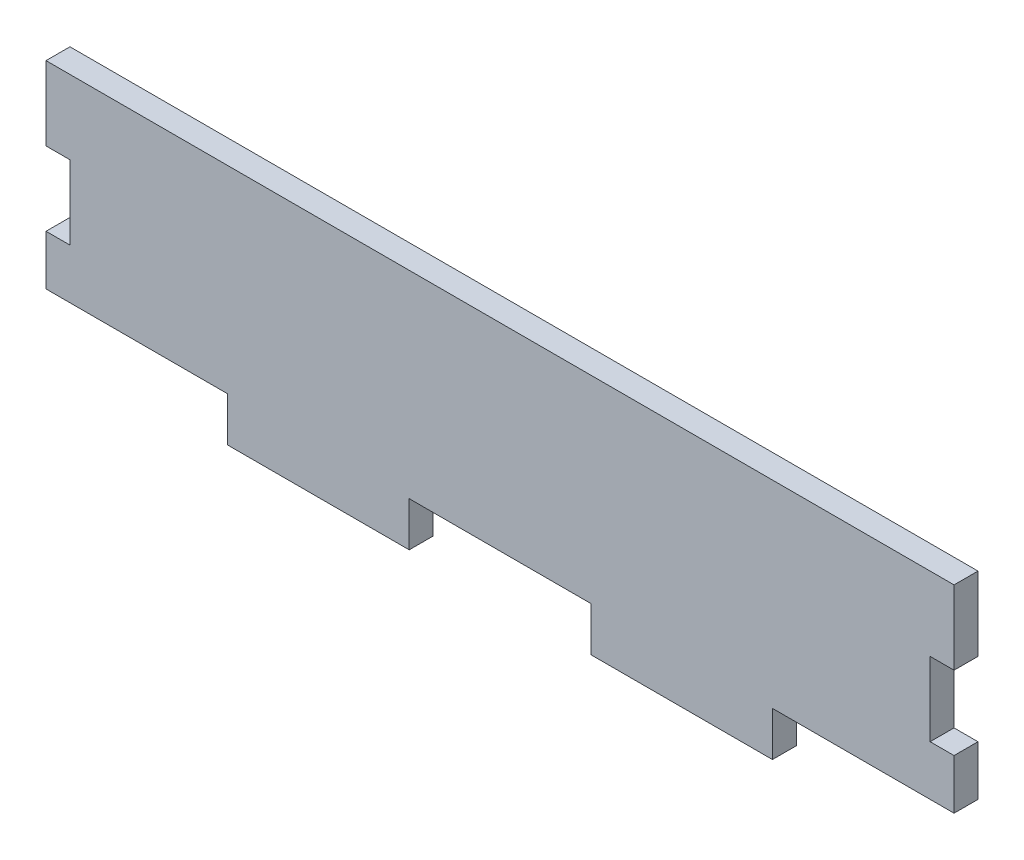
ISO-10303-21;
HEADER;
FILE_DESCRIPTION(('STEP AP214'),'2;1');
FILE_NAME('part.step','',(''),(''),'','','');
FILE_SCHEMA(('AUTOMOTIVE_DESIGN { 1 0 10303 214 1 1 1 1 }'));
ENDSEC;
DATA;
#1=APPLICATION_CONTEXT('core data for automotive mechanical design processes');
#2=APPLICATION_PROTOCOL_DEFINITION('international standard','automotive_design',2000,#1);
#3=PRODUCT_CONTEXT('',#1,'mechanical');
#4=PRODUCT('Part','Part','',(#3));
#5=PRODUCT_RELATED_PRODUCT_CATEGORY('part','',(#4));
#6=PRODUCT_DEFINITION_FORMATION('','',#4);
#7=PRODUCT_DEFINITION_CONTEXT('part definition',#1,'design');
#8=PRODUCT_DEFINITION('design','',#6,#7);
#9=PRODUCT_DEFINITION_SHAPE('','',#8);
#10=(LENGTH_UNIT() NAMED_UNIT(*) SI_UNIT(.MILLI.,.METRE.));
#11=(NAMED_UNIT(*) PLANE_ANGLE_UNIT() SI_UNIT($,.RADIAN.));
#12=(NAMED_UNIT(*) SI_UNIT($,.STERADIAN.) SOLID_ANGLE_UNIT());
#13=UNCERTAINTY_MEASURE_WITH_UNIT(LENGTH_MEASURE(1.E-05),#10,'distance_accuracy_value','');
#14=(GEOMETRIC_REPRESENTATION_CONTEXT(3) GLOBAL_UNCERTAINTY_ASSIGNED_CONTEXT((#13)) GLOBAL_UNIT_ASSIGNED_CONTEXT((#10,
#11,#12)) REPRESENTATION_CONTEXT('',''));
#15=CARTESIAN_POINT('',(0.,0.,0.));
#16=DIRECTION('',(0.,0.,1.));
#17=DIRECTION('',(1.,0.,0.));
#18=AXIS2_PLACEMENT_3D('',#15,#16,#17);
#19=CARTESIAN_POINT('',(-51.2,4.16666666666666,2.7));
#20=DIRECTION('',(1.,0.,0.));
#21=DIRECTION('',(0.,0.,-1.));
#22=AXIS2_PLACEMENT_3D('',#19,#20,#21);
#23=PLANE('',#22);
#24=DIRECTION('',(0.,-1.,0.));
#25=VECTOR('',#24,1.);
#26=CARTESIAN_POINT('',(-51.2,4.16666666666666,0.));
#27=LINE('',#26,#25);
#28=CARTESIAN_POINT('',(-51.2,12.5,0.));
#29=VERTEX_POINT('',#28);
#30=CARTESIAN_POINT('',(-51.2,4.16666666666666,0.));
#31=VERTEX_POINT('',#30);
#32=EDGE_CURVE('E201',#29,#31,#27,.T.);
#33=ORIENTED_EDGE('',*,*,#32,.T.);
#34=DIRECTION('',(0.,0.,-1.));
#35=VECTOR('',#34,1.);
#36=CARTESIAN_POINT('',(-51.2,4.16666666666666,2.7));
#37=LINE('',#36,#35);
#38=CARTESIAN_POINT('',(-51.2,4.16666666666666,2.7));
#39=VERTEX_POINT('',#38);
#40=EDGE_CURVE('E11',#39,#31,#37,.T.);
#41=ORIENTED_EDGE('',*,*,#40,.F.);
#42=DIRECTION('',(0.,-1.,0.));
#43=VECTOR('',#42,1.);
#44=CARTESIAN_POINT('',(-51.2,4.16666666666666,2.7));
#45=LINE('',#44,#43);
#46=CARTESIAN_POINT('',(-51.2,12.5,2.7));
#47=VERTEX_POINT('',#46);
#48=EDGE_CURVE('E243',#47,#39,#45,.T.);
#49=ORIENTED_EDGE('',*,*,#48,.F.);
#50=DIRECTION('',(0.,0.,-1.));
#51=VECTOR('',#50,1.);
#52=CARTESIAN_POINT('',(-51.2,12.5,2.7));
#53=LINE('',#52,#51);
#54=EDGE_CURVE('E197',#47,#29,#53,.T.);
#55=ORIENTED_EDGE('',*,*,#54,.T.);
#56=EDGE_LOOP('',(#33,#41,#49,#55));
#57=FACE_BOUND('',#56,.T.);
#58=ADVANCED_FACE('F33',(#57),#23,.F.);
#59=CARTESIAN_POINT('',(-51.2,4.16666666666666,2.7));
#60=DIRECTION('',(0.,1.,0.));
#61=DIRECTION('',(0.,0.,1.));
#62=AXIS2_PLACEMENT_3D('',#59,#60,#61);
#63=PLANE('',#62);
#64=DIRECTION('',(1.,0.,0.));
#65=VECTOR('',#64,1.);
#66=CARTESIAN_POINT('',(-51.2,4.16666666666666,0.));
#67=LINE('',#66,#65);
#68=CARTESIAN_POINT('',(-48.5,4.16666666666666,0.));
#69=VERTEX_POINT('',#68);
#70=EDGE_CURVE('E204',#31,#69,#67,.T.);
#71=ORIENTED_EDGE('',*,*,#70,.T.);
#72=DIRECTION('',(0.,0.,-1.));
#73=VECTOR('',#72,1.);
#74=CARTESIAN_POINT('',(-48.5,4.16666666666666,2.7));
#75=LINE('',#74,#73);
#76=CARTESIAN_POINT('',(-48.5,4.16666666666666,2.7));
#77=VERTEX_POINT('',#76);
#78=EDGE_CURVE('E41',#77,#69,#75,.T.);
#79=ORIENTED_EDGE('',*,*,#78,.F.);
#80=DIRECTION('',(1.,0.,0.));
#81=VECTOR('',#80,1.);
#82=CARTESIAN_POINT('',(-51.2,4.16666666666666,2.7));
#83=LINE('',#82,#81);
#84=EDGE_CURVE('E128',#39,#77,#83,.T.);
#85=ORIENTED_EDGE('',*,*,#84,.F.);
#86=ORIENTED_EDGE('',*,*,#40,.T.);
#87=EDGE_LOOP('',(#71,#79,#85,#86));
#88=FACE_BOUND('',#87,.T.);
#89=ADVANCED_FACE('F361',(#88),#63,.F.);
#90=CARTESIAN_POINT('',(-48.5,4.16666666666666,2.7));
#91=DIRECTION('',(1.,0.,0.));
#92=DIRECTION('',(0.,0.,-1.));
#93=AXIS2_PLACEMENT_3D('',#90,#91,#92);
#94=PLANE('',#93);
#95=DIRECTION('',(0.,-1.,0.));
#96=VECTOR('',#95,1.);
#97=CARTESIAN_POINT('',(-48.5,4.16666666666666,0.));
#98=LINE('',#97,#96);
#99=CARTESIAN_POINT('',(-48.5,-4.16666666666667,0.));
#100=VERTEX_POINT('',#99);
#101=EDGE_CURVE('E206',#69,#100,#98,.T.);
#102=ORIENTED_EDGE('',*,*,#101,.T.);
#103=DIRECTION('',(0.,0.,-1.));
#104=VECTOR('',#103,1.);
#105=CARTESIAN_POINT('',(-48.5,-4.16666666666667,2.7));
#106=LINE('',#105,#104);
#107=CARTESIAN_POINT('',(-48.5,-4.16666666666667,2.7));
#108=VERTEX_POINT('',#107);
#109=EDGE_CURVE('E286',#108,#100,#106,.T.);
#110=ORIENTED_EDGE('',*,*,#109,.F.);
#111=DIRECTION('',(0.,-1.,0.));
#112=VECTOR('',#111,1.);
#113=CARTESIAN_POINT('',(-48.5,4.16666666666666,2.7));
#114=LINE('',#113,#112);
#115=EDGE_CURVE('E294',#77,#108,#114,.T.);
#116=ORIENTED_EDGE('',*,*,#115,.F.);
#117=ORIENTED_EDGE('',*,*,#78,.T.);
#118=EDGE_LOOP('',(#102,#110,#116,#117));
#119=FACE_BOUND('',#118,.T.);
#120=ADVANCED_FACE('F292',(#119),#94,.F.);
#121=CARTESIAN_POINT('',(-51.2,-4.16666666666668,2.7));
#122=DIRECTION('',(0.,-1.,0.));
#123=DIRECTION('',(1.,0.,0.));
#124=AXIS2_PLACEMENT_3D('',#121,#122,#123);
#125=PLANE('',#124);
#126=DIRECTION('',(-1.,0.,0.));
#127=VECTOR('',#126,1.);
#128=CARTESIAN_POINT('',(-51.2,-4.16666666666668,0.));
#129=LINE('',#128,#127);
#130=CARTESIAN_POINT('',(-51.2,-4.16666666666668,0.));
#131=VERTEX_POINT('',#130);
#132=EDGE_CURVE('E208',#100,#131,#129,.T.);
#133=ORIENTED_EDGE('',*,*,#132,.T.);
#134=DIRECTION('',(0.,0.,-1.));
#135=VECTOR('',#134,1.);
#136=CARTESIAN_POINT('',(-51.2,-4.16666666666668,2.7));
#137=LINE('',#136,#135);
#138=CARTESIAN_POINT('',(-51.2,-4.16666666666668,2.7));
#139=VERTEX_POINT('',#138);
#140=EDGE_CURVE('E283',#139,#131,#137,.T.);
#141=ORIENTED_EDGE('',*,*,#140,.F.);
#142=DIRECTION('',(-1.,0.,0.));
#143=VECTOR('',#142,1.);
#144=CARTESIAN_POINT('',(-51.2,-4.16666666666668,2.7));
#145=LINE('',#144,#143);
#146=EDGE_CURVE('E312',#108,#139,#145,.T.);
#147=ORIENTED_EDGE('',*,*,#146,.F.);
#148=ORIENTED_EDGE('',*,*,#109,.T.);
#149=EDGE_LOOP('',(#133,#141,#147,#148));
#150=FACE_BOUND('',#149,.T.);
#151=ADVANCED_FACE('F303',(#150),#125,.F.);
#152=CARTESIAN_POINT('',(-51.2,-9.80000000000001,2.7));
#153=DIRECTION('',(1.,0.,0.));
#154=DIRECTION('',(0.,0.,-1.));
#155=AXIS2_PLACEMENT_3D('',#152,#153,#154);
#156=PLANE('',#155);
#157=DIRECTION('',(0.,-1.,0.));
#158=VECTOR('',#157,1.);
#159=CARTESIAN_POINT('',(-51.2,-9.80000000000001,0.));
#160=LINE('',#159,#158);
#161=CARTESIAN_POINT('',(-51.2,-9.80000000000001,0.));
#162=VERTEX_POINT('',#161);
#163=EDGE_CURVE('E210',#131,#162,#160,.T.);
#164=ORIENTED_EDGE('',*,*,#163,.T.);
#165=DIRECTION('',(0.,0.,-1.));
#166=VECTOR('',#165,1.);
#167=CARTESIAN_POINT('',(-51.2,-9.80000000000001,2.7));
#168=LINE('',#167,#166);
#169=CARTESIAN_POINT('',(-51.2,-9.80000000000001,2.7));
#170=VERTEX_POINT('',#169);
#171=EDGE_CURVE('E280',#170,#162,#168,.T.);
#172=ORIENTED_EDGE('',*,*,#171,.F.);
#173=DIRECTION('',(0.,-1.,0.));
#174=VECTOR('',#173,1.);
#175=CARTESIAN_POINT('',(-51.2,-9.80000000000001,2.7));
#176=LINE('',#175,#174);
#177=EDGE_CURVE('E309',#139,#170,#176,.T.);
#178=ORIENTED_EDGE('',*,*,#177,.F.);
#179=ORIENTED_EDGE('',*,*,#140,.T.);
#180=EDGE_LOOP('',(#164,#172,#178,#179));
#181=FACE_BOUND('',#180,.T.);
#182=ADVANCED_FACE('F307',(#181),#156,.F.);
#183=CARTESIAN_POINT('',(-30.72,-9.80000000000001,2.7));
#184=DIRECTION('',(0.,1.,0.));
#185=DIRECTION('',(0.,0.,1.));
#186=AXIS2_PLACEMENT_3D('',#183,#184,#185);
#187=PLANE('',#186);
#188=DIRECTION('',(1.,0.,0.));
#189=VECTOR('',#188,1.);
#190=CARTESIAN_POINT('',(-30.72,-9.80000000000001,0.));
#191=LINE('',#190,#189);
#192=CARTESIAN_POINT('',(-30.72,-9.80000000000001,0.));
#193=VERTEX_POINT('',#192);
#194=EDGE_CURVE('E212',#162,#193,#191,.T.);
#195=ORIENTED_EDGE('',*,*,#194,.T.);
#196=DIRECTION('',(0.,0.,-1.));
#197=VECTOR('',#196,1.);
#198=CARTESIAN_POINT('',(-30.72,-9.80000000000001,2.7));
#199=LINE('',#198,#197);
#200=CARTESIAN_POINT('',(-30.72,-9.80000000000001,2.7));
#201=VERTEX_POINT('',#200);
#202=EDGE_CURVE('E277',#201,#193,#199,.T.);
#203=ORIENTED_EDGE('',*,*,#202,.F.);
#204=DIRECTION('',(1.,0.,0.));
#205=VECTOR('',#204,1.);
#206=CARTESIAN_POINT('',(-30.72,-9.80000000000001,2.7));
#207=LINE('',#206,#205);
#208=EDGE_CURVE('E311',#170,#201,#207,.T.);
#209=ORIENTED_EDGE('',*,*,#208,.F.);
#210=ORIENTED_EDGE('',*,*,#171,.T.);
#211=EDGE_LOOP('',(#195,#203,#209,#210));
#212=FACE_BOUND('',#211,.T.);
#213=ADVANCED_FACE('F374',(#212),#187,.F.);
#214=CARTESIAN_POINT('',(-30.72,-12.5,2.7));
#215=DIRECTION('',(1.,0.,0.));
#216=DIRECTION('',(0.,0.,-1.));
#217=AXIS2_PLACEMENT_3D('',#214,#215,#216);
#218=PLANE('',#217);
#219=DIRECTION('',(0.,-1.,0.));
#220=VECTOR('',#219,1.);
#221=CARTESIAN_POINT('',(-30.72,-12.5,0.));
#222=LINE('',#221,#220);
#223=CARTESIAN_POINT('',(-30.72,-14.8,0.));
#224=VERTEX_POINT('',#223);
#225=EDGE_CURVE('E215',#193,#224,#222,.T.);
#226=ORIENTED_EDGE('',*,*,#225,.T.);
#227=DIRECTION('',(0.,0.,-1.));
#228=VECTOR('',#227,1.);
#229=CARTESIAN_POINT('',(-30.72,-14.8,2.7));
#230=LINE('',#229,#228);
#231=CARTESIAN_POINT('',(-30.72,-14.8,2.7));
#232=VERTEX_POINT('',#231);
#233=EDGE_CURVE('E274',#232,#224,#230,.T.);
#234=ORIENTED_EDGE('',*,*,#233,.F.);
#235=DIRECTION('',(0.,-1.,0.));
#236=VECTOR('',#235,1.);
#237=CARTESIAN_POINT('',(-30.72,-12.5,2.7));
#238=LINE('',#237,#236);
#239=EDGE_CURVE('E314',#201,#232,#238,.T.);
#240=ORIENTED_EDGE('',*,*,#239,.F.);
#241=ORIENTED_EDGE('',*,*,#202,.T.);
#242=EDGE_LOOP('',(#226,#234,#240,#241));
#243=FACE_BOUND('',#242,.T.);
#244=ADVANCED_FACE('F377',(#243),#218,.F.);
#245=CARTESIAN_POINT('',(-30.72,-14.8,2.7));
#246=DIRECTION('',(0.,1.,0.));
#247=DIRECTION('',(0.,0.,1.));
#248=AXIS2_PLACEMENT_3D('',#245,#246,#247);
#249=PLANE('',#248);
#250=DIRECTION('',(1.,0.,0.));
#251=VECTOR('',#250,1.);
#252=CARTESIAN_POINT('',(-30.72,-14.8,0.));
#253=LINE('',#252,#251);
#254=CARTESIAN_POINT('',(-10.24,-14.8,0.));
#255=VERTEX_POINT('',#254);
#256=EDGE_CURVE('E217',#224,#255,#253,.T.);
#257=ORIENTED_EDGE('',*,*,#256,.T.);
#258=DIRECTION('',(0.,0.,-1.));
#259=VECTOR('',#258,1.);
#260=CARTESIAN_POINT('',(-10.24,-14.8,2.7));
#261=LINE('',#260,#259);
#262=CARTESIAN_POINT('',(-10.24,-14.8,2.7));
#263=VERTEX_POINT('',#262);
#264=EDGE_CURVE('E271',#263,#255,#261,.T.);
#265=ORIENTED_EDGE('',*,*,#264,.F.);
#266=DIRECTION('',(1.,0.,0.));
#267=VECTOR('',#266,1.);
#268=CARTESIAN_POINT('',(-30.72,-14.8,2.7));
#269=LINE('',#268,#267);
#270=EDGE_CURVE('E320',#232,#263,#269,.T.);
#271=ORIENTED_EDGE('',*,*,#270,.F.);
#272=ORIENTED_EDGE('',*,*,#233,.T.);
#273=EDGE_LOOP('',(#257,#265,#271,#272));
#274=FACE_BOUND('',#273,.T.);
#275=ADVANCED_FACE('F381',(#274),#249,.F.);
#276=CARTESIAN_POINT('',(-10.24,-12.5,2.7));
#277=DIRECTION('',(-1.,0.,0.));
#278=DIRECTION('',(0.,0.,1.));
#279=AXIS2_PLACEMENT_3D('',#276,#277,#278);
#280=PLANE('',#279);
#281=DIRECTION('',(0.,1.,0.));
#282=VECTOR('',#281,1.);
#283=CARTESIAN_POINT('',(-10.24,-12.5,0.));
#284=LINE('',#283,#282);
#285=CARTESIAN_POINT('',(-10.24,-9.80000000000001,0.));
#286=VERTEX_POINT('',#285);
#287=EDGE_CURVE('E220',#255,#286,#284,.T.);
#288=ORIENTED_EDGE('',*,*,#287,.T.);
#289=DIRECTION('',(0.,0.,-1.));
#290=VECTOR('',#289,1.);
#291=CARTESIAN_POINT('',(-10.24,-9.80000000000001,2.7));
#292=LINE('',#291,#290);
#293=CARTESIAN_POINT('',(-10.24,-9.80000000000001,2.7));
#294=VERTEX_POINT('',#293);
#295=EDGE_CURVE('E268',#294,#286,#292,.T.);
#296=ORIENTED_EDGE('',*,*,#295,.F.);
#297=DIRECTION('',(0.,1.,0.));
#298=VECTOR('',#297,1.);
#299=CARTESIAN_POINT('',(-10.24,-12.5,2.7));
#300=LINE('',#299,#298);
#301=EDGE_CURVE('E322',#263,#294,#300,.T.);
#302=ORIENTED_EDGE('',*,*,#301,.F.);
#303=ORIENTED_EDGE('',*,*,#264,.T.);
#304=EDGE_LOOP('',(#288,#296,#302,#303));
#305=FACE_BOUND('',#304,.T.);
#306=ADVANCED_FACE('F385',(#305),#280,.F.);
#307=CARTESIAN_POINT('',(10.24,-9.80000000000001,2.7));
#308=DIRECTION('',(0.,1.,0.));
#309=DIRECTION('',(0.,0.,1.));
#310=AXIS2_PLACEMENT_3D('',#307,#308,#309);
#311=PLANE('',#310);
#312=DIRECTION('',(1.,0.,0.));
#313=VECTOR('',#312,1.);
#314=CARTESIAN_POINT('',(10.24,-9.80000000000001,0.));
#315=LINE('',#314,#313);
#316=CARTESIAN_POINT('',(10.24,-9.80000000000001,0.));
#317=VERTEX_POINT('',#316);
#318=EDGE_CURVE('E222',#286,#317,#315,.T.);
#319=ORIENTED_EDGE('',*,*,#318,.T.);
#320=DIRECTION('',(0.,0.,-1.));
#321=VECTOR('',#320,1.);
#322=CARTESIAN_POINT('',(10.24,-9.80000000000001,2.7));
#323=LINE('',#322,#321);
#324=CARTESIAN_POINT('',(10.24,-9.80000000000001,2.7));
#325=VERTEX_POINT('',#324);
#326=EDGE_CURVE('E265',#325,#317,#323,.T.);
#327=ORIENTED_EDGE('',*,*,#326,.F.);
#328=DIRECTION('',(1.,0.,0.));
#329=VECTOR('',#328,1.);
#330=CARTESIAN_POINT('',(10.24,-9.80000000000001,2.7));
#331=LINE('',#330,#329);
#332=EDGE_CURVE('E324',#294,#325,#331,.T.);
#333=ORIENTED_EDGE('',*,*,#332,.F.);
#334=ORIENTED_EDGE('',*,*,#295,.T.);
#335=EDGE_LOOP('',(#319,#327,#333,#334));
#336=FACE_BOUND('',#335,.T.);
#337=ADVANCED_FACE('F389',(#336),#311,.F.);
#338=CARTESIAN_POINT('',(10.24,-12.5,2.7));
#339=DIRECTION('',(1.,0.,0.));
#340=DIRECTION('',(0.,1.,0.));
#341=AXIS2_PLACEMENT_3D('',#338,#339,#340);
#342=PLANE('',#341);
#343=DIRECTION('',(0.,-1.,0.));
#344=VECTOR('',#343,1.);
#345=CARTESIAN_POINT('',(10.24,-12.5,0.));
#346=LINE('',#345,#344);
#347=CARTESIAN_POINT('',(10.24,-14.8,0.));
#348=VERTEX_POINT('',#347);
#349=EDGE_CURVE('E225',#317,#348,#346,.T.);
#350=ORIENTED_EDGE('',*,*,#349,.T.);
#351=DIRECTION('',(0.,0.,-1.));
#352=VECTOR('',#351,1.);
#353=CARTESIAN_POINT('',(10.24,-14.8,2.7));
#354=LINE('',#353,#352);
#355=CARTESIAN_POINT('',(10.24,-14.8,2.7));
#356=VERTEX_POINT('',#355);
#357=EDGE_CURVE('E262',#356,#348,#354,.T.);
#358=ORIENTED_EDGE('',*,*,#357,.F.);
#359=DIRECTION('',(0.,-1.,0.));
#360=VECTOR('',#359,1.);
#361=CARTESIAN_POINT('',(10.24,-12.5,2.7));
#362=LINE('',#361,#360);
#363=EDGE_CURVE('E326',#325,#356,#362,.T.);
#364=ORIENTED_EDGE('',*,*,#363,.F.);
#365=ORIENTED_EDGE('',*,*,#326,.T.);
#366=EDGE_LOOP('',(#350,#358,#364,#365));
#367=FACE_BOUND('',#366,.T.);
#368=ADVANCED_FACE('F393',(#367),#342,.F.);
#369=CARTESIAN_POINT('',(10.24,-14.8,2.7));
#370=DIRECTION('',(0.,1.,0.));
#371=DIRECTION('',(0.,0.,1.));
#372=AXIS2_PLACEMENT_3D('',#369,#370,#371);
#373=PLANE('',#372);
#374=DIRECTION('',(1.,0.,0.));
#375=VECTOR('',#374,1.);
#376=CARTESIAN_POINT('',(10.24,-14.8,0.));
#377=LINE('',#376,#375);
#378=CARTESIAN_POINT('',(30.72,-14.8,0.));
#379=VERTEX_POINT('',#378);
#380=EDGE_CURVE('E227',#348,#379,#377,.T.);
#381=ORIENTED_EDGE('',*,*,#380,.T.);
#382=DIRECTION('',(0.,0.,-1.));
#383=VECTOR('',#382,1.);
#384=CARTESIAN_POINT('',(30.72,-14.8,2.7));
#385=LINE('',#384,#383);
#386=CARTESIAN_POINT('',(30.72,-14.8,2.7));
#387=VERTEX_POINT('',#386);
#388=EDGE_CURVE('E259',#387,#379,#385,.T.);
#389=ORIENTED_EDGE('',*,*,#388,.F.);
#390=DIRECTION('',(1.,0.,0.));
#391=VECTOR('',#390,1.);
#392=CARTESIAN_POINT('',(10.24,-14.8,2.7));
#393=LINE('',#392,#391);
#394=EDGE_CURVE('E328',#356,#387,#393,.T.);
#395=ORIENTED_EDGE('',*,*,#394,.F.);
#396=ORIENTED_EDGE('',*,*,#357,.T.);
#397=EDGE_LOOP('',(#381,#389,#395,#396));
#398=FACE_BOUND('',#397,.T.);
#399=ADVANCED_FACE('F397',(#398),#373,.F.);
#400=CARTESIAN_POINT('',(30.72,-12.5,2.7));
#401=DIRECTION('',(-1.,0.,0.));
#402=DIRECTION('',(0.,0.,1.));
#403=AXIS2_PLACEMENT_3D('',#400,#401,#402);
#404=PLANE('',#403);
#405=DIRECTION('',(0.,1.,0.));
#406=VECTOR('',#405,1.);
#407=CARTESIAN_POINT('',(30.72,-12.5,0.));
#408=LINE('',#407,#406);
#409=CARTESIAN_POINT('',(30.72,-9.80000000000001,0.));
#410=VERTEX_POINT('',#409);
#411=EDGE_CURVE('E230',#379,#410,#408,.T.);
#412=ORIENTED_EDGE('',*,*,#411,.T.);
#413=DIRECTION('',(0.,0.,-1.));
#414=VECTOR('',#413,1.);
#415=CARTESIAN_POINT('',(30.72,-9.80000000000001,2.7));
#416=LINE('',#415,#414);
#417=CARTESIAN_POINT('',(30.72,-9.80000000000001,2.7));
#418=VERTEX_POINT('',#417);
#419=EDGE_CURVE('E256',#418,#410,#416,.T.);
#420=ORIENTED_EDGE('',*,*,#419,.F.);
#421=DIRECTION('',(0.,1.,0.));
#422=VECTOR('',#421,1.);
#423=CARTESIAN_POINT('',(30.72,-14.8,2.7));
#424=LINE('',#423,#422);
#425=EDGE_CURVE('E330',#387,#418,#424,.T.);
#426=ORIENTED_EDGE('',*,*,#425,.F.);
#427=ORIENTED_EDGE('',*,*,#388,.T.);
#428=EDGE_LOOP('',(#412,#420,#426,#427));
#429=FACE_BOUND('',#428,.T.);
#430=ADVANCED_FACE('F401',(#429),#404,.F.);
#431=CARTESIAN_POINT('',(51.2,-9.80000000000001,2.7));
#432=DIRECTION('',(0.,1.,0.));
#433=DIRECTION('',(0.,0.,1.));
#434=AXIS2_PLACEMENT_3D('',#431,#432,#433);
#435=PLANE('',#434);
#436=DIRECTION('',(1.,0.,0.));
#437=VECTOR('',#436,1.);
#438=CARTESIAN_POINT('',(51.2,-9.80000000000001,0.));
#439=LINE('',#438,#437);
#440=CARTESIAN_POINT('',(51.2,-9.80000000000001,0.));
#441=VERTEX_POINT('',#440);
#442=EDGE_CURVE('E232',#410,#441,#439,.T.);
#443=ORIENTED_EDGE('',*,*,#442,.T.);
#444=DIRECTION('',(0.,0.,-1.));
#445=VECTOR('',#444,1.);
#446=CARTESIAN_POINT('',(51.2,-9.80000000000001,2.7));
#447=LINE('',#446,#445);
#448=CARTESIAN_POINT('',(51.2,-9.80000000000001,2.7));
#449=VERTEX_POINT('',#448);
#450=EDGE_CURVE('E253',#449,#441,#447,.T.);
#451=ORIENTED_EDGE('',*,*,#450,.F.);
#452=DIRECTION('',(1.,0.,0.));
#453=VECTOR('',#452,1.);
#454=CARTESIAN_POINT('',(51.2,-9.80000000000001,2.7));
#455=LINE('',#454,#453);
#456=EDGE_CURVE('E332',#418,#449,#455,.T.);
#457=ORIENTED_EDGE('',*,*,#456,.F.);
#458=ORIENTED_EDGE('',*,*,#419,.T.);
#459=EDGE_LOOP('',(#443,#451,#457,#458));
#460=FACE_BOUND('',#459,.T.);
#461=ADVANCED_FACE('F405',(#460),#435,.F.);
#462=CARTESIAN_POINT('',(51.2,-4.1666666666667,2.7));
#463=DIRECTION('',(-1.,0.,0.));
#464=DIRECTION('',(0.,-1.,0.));
#465=AXIS2_PLACEMENT_3D('',#462,#463,#464);
#466=PLANE('',#465);
#467=DIRECTION('',(0.,1.,0.));
#468=VECTOR('',#467,1.);
#469=CARTESIAN_POINT('',(51.2,-4.1666666666667,0.));
#470=LINE('',#469,#468);
#471=CARTESIAN_POINT('',(51.2,-4.1666666666667,0.));
#472=VERTEX_POINT('',#471);
#473=EDGE_CURVE('E234',#441,#472,#470,.T.);
#474=ORIENTED_EDGE('',*,*,#473,.T.);
#475=DIRECTION('',(0.,0.,-1.));
#476=VECTOR('',#475,1.);
#477=CARTESIAN_POINT('',(51.2,-4.1666666666667,2.7));
#478=LINE('',#477,#476);
#479=CARTESIAN_POINT('',(51.2,-4.1666666666667,2.7));
#480=VERTEX_POINT('',#479);
#481=EDGE_CURVE('E250',#480,#472,#478,.T.);
#482=ORIENTED_EDGE('',*,*,#481,.F.);
#483=DIRECTION('',(0.,1.,0.));
#484=VECTOR('',#483,1.);
#485=CARTESIAN_POINT('',(51.2,-4.1666666666667,2.7));
#486=LINE('',#485,#484);
#487=EDGE_CURVE('E334',#449,#480,#486,.T.);
#488=ORIENTED_EDGE('',*,*,#487,.F.);
#489=ORIENTED_EDGE('',*,*,#450,.T.);
#490=EDGE_LOOP('',(#474,#482,#488,#489));
#491=FACE_BOUND('',#490,.T.);
#492=ADVANCED_FACE('F409',(#491),#466,.F.);
#493=CARTESIAN_POINT('',(51.2,-4.1666666666667,2.7));
#494=DIRECTION('',(0.,-1.,0.));
#495=DIRECTION('',(1.,0.,0.));
#496=AXIS2_PLACEMENT_3D('',#493,#494,#495);
#497=PLANE('',#496);
#498=DIRECTION('',(-1.,0.,0.));
#499=VECTOR('',#498,1.);
#500=CARTESIAN_POINT('',(51.2,-4.1666666666667,0.));
#501=LINE('',#500,#499);
#502=CARTESIAN_POINT('',(48.5,-4.1666666666667,0.));
#503=VERTEX_POINT('',#502);
#504=EDGE_CURVE('E236',#472,#503,#501,.T.);
#505=ORIENTED_EDGE('',*,*,#504,.T.);
#506=DIRECTION('',(0.,0.,-1.));
#507=VECTOR('',#506,1.);
#508=CARTESIAN_POINT('',(48.5,-4.1666666666667,2.7));
#509=LINE('',#508,#507);
#510=CARTESIAN_POINT('',(48.5,-4.1666666666667,2.7));
#511=VERTEX_POINT('',#510);
#512=EDGE_CURVE('E247',#511,#503,#509,.T.);
#513=ORIENTED_EDGE('',*,*,#512,.F.);
#514=DIRECTION('',(-1.,0.,0.));
#515=VECTOR('',#514,1.);
#516=CARTESIAN_POINT('',(51.2,-4.1666666666667,2.7));
#517=LINE('',#516,#515);
#518=EDGE_CURVE('E336',#480,#511,#517,.T.);
#519=ORIENTED_EDGE('',*,*,#518,.F.);
#520=ORIENTED_EDGE('',*,*,#481,.T.);
#521=EDGE_LOOP('',(#505,#513,#519,#520));
#522=FACE_BOUND('',#521,.T.);
#523=ADVANCED_FACE('F342',(#522),#497,.F.);
#524=CARTESIAN_POINT('',(48.5,4.16666666666663,2.7));
#525=DIRECTION('',(-1.,0.,0.));
#526=DIRECTION('',(0.,0.,1.));
#527=AXIS2_PLACEMENT_3D('',#524,#525,#526);
#528=PLANE('',#527);
#529=DIRECTION('',(0.,1.,0.));
#530=VECTOR('',#529,1.);
#531=CARTESIAN_POINT('',(48.5,4.16666666666663,0.));
#532=LINE('',#531,#530);
#533=CARTESIAN_POINT('',(48.5,4.16666666666663,0.));
#534=VERTEX_POINT('',#533);
#535=EDGE_CURVE('E238',#503,#534,#532,.T.);
#536=ORIENTED_EDGE('',*,*,#535,.T.);
#537=DIRECTION('',(0.,0.,-1.));
#538=VECTOR('',#537,1.);
#539=CARTESIAN_POINT('',(48.5,4.16666666666663,2.7));
#540=LINE('',#539,#538);
#541=CARTESIAN_POINT('',(48.5,4.16666666666663,2.7));
#542=VERTEX_POINT('',#541);
#543=EDGE_CURVE('E192',#542,#534,#540,.T.);
#544=ORIENTED_EDGE('',*,*,#543,.F.);
#545=DIRECTION('',(0.,1.,0.));
#546=VECTOR('',#545,1.);
#547=CARTESIAN_POINT('',(48.5,4.16666666666663,2.7));
#548=LINE('',#547,#546);
#549=EDGE_CURVE('E183',#511,#542,#548,.T.);
#550=ORIENTED_EDGE('',*,*,#549,.F.);
#551=ORIENTED_EDGE('',*,*,#512,.T.);
#552=EDGE_LOOP('',(#536,#544,#550,#551));
#553=FACE_BOUND('',#552,.T.);
#554=ADVANCED_FACE('F346',(#553),#528,.F.);
#555=CARTESIAN_POINT('',(51.2,4.16666666666663,2.7));
#556=DIRECTION('',(0.,1.,0.));
#557=DIRECTION('',(0.,0.,1.));
#558=AXIS2_PLACEMENT_3D('',#555,#556,#557);
#559=PLANE('',#558);
#560=DIRECTION('',(1.,0.,0.));
#561=VECTOR('',#560,1.);
#562=CARTESIAN_POINT('',(51.2,4.16666666666663,0.));
#563=LINE('',#562,#561);
#564=CARTESIAN_POINT('',(51.2,4.16666666666663,0.));
#565=VERTEX_POINT('',#564);
#566=EDGE_CURVE('E191',#534,#565,#563,.T.);
#567=ORIENTED_EDGE('',*,*,#566,.T.);
#568=DIRECTION('',(0.,0.,-1.));
#569=VECTOR('',#568,1.);
#570=CARTESIAN_POINT('',(51.2,4.16666666666663,2.7));
#571=LINE('',#570,#569);
#572=CARTESIAN_POINT('',(51.2,4.16666666666663,2.7));
#573=VERTEX_POINT('',#572);
#574=EDGE_CURVE('E188',#573,#565,#571,.T.);
#575=ORIENTED_EDGE('',*,*,#574,.F.);
#576=DIRECTION('',(1.,0.,0.));
#577=VECTOR('',#576,1.);
#578=CARTESIAN_POINT('',(51.2,4.16666666666663,2.7));
#579=LINE('',#578,#577);
#580=EDGE_CURVE('E177',#542,#573,#579,.T.);
#581=ORIENTED_EDGE('',*,*,#580,.F.);
#582=ORIENTED_EDGE('',*,*,#543,.T.);
#583=EDGE_LOOP('',(#567,#575,#581,#582));
#584=FACE_BOUND('',#583,.T.);
#585=ADVANCED_FACE('F189',(#584),#559,.F.);
#586=CARTESIAN_POINT('',(51.2,4.16666666666663,2.7));
#587=DIRECTION('',(-1.,0.,0.));
#588=DIRECTION('',(0.,-1.,0.));
#589=AXIS2_PLACEMENT_3D('',#586,#587,#588);
#590=PLANE('',#589);
#591=DIRECTION('',(0.,1.,0.));
#592=VECTOR('',#591,1.);
#593=CARTESIAN_POINT('',(51.2,4.16666666666663,0.));
#594=LINE('',#593,#592);
#595=CARTESIAN_POINT('',(51.2,12.5,0.));
#596=VERTEX_POINT('',#595);
#597=EDGE_CURVE('E114',#565,#596,#594,.T.);
#598=ORIENTED_EDGE('',*,*,#597,.T.);
#599=DIRECTION('',(0.,0.,-1.));
#600=VECTOR('',#599,1.);
#601=CARTESIAN_POINT('',(51.2,12.5,2.7));
#602=LINE('',#601,#600);
#603=CARTESIAN_POINT('',(51.2,12.5,2.7));
#604=VERTEX_POINT('',#603);
#605=EDGE_CURVE('E193',#604,#596,#602,.T.);
#606=ORIENTED_EDGE('',*,*,#605,.F.);
#607=DIRECTION('',(0.,1.,0.));
#608=VECTOR('',#607,1.);
#609=CARTESIAN_POINT('',(51.2,4.16666666666663,2.7));
#610=LINE('',#609,#608);
#611=EDGE_CURVE('E181',#573,#604,#610,.T.);
#612=ORIENTED_EDGE('',*,*,#611,.F.);
#613=ORIENTED_EDGE('',*,*,#574,.T.);
#614=EDGE_LOOP('',(#598,#606,#612,#613));
#615=FACE_BOUND('',#614,.T.);
#616=ADVANCED_FACE('F195',(#615),#590,.F.);
#617=CARTESIAN_POINT('',(-51.2,12.5,2.7));
#618=DIRECTION('',(0.,-1.,0.));
#619=DIRECTION('',(1.,0.,0.));
#620=AXIS2_PLACEMENT_3D('',#617,#618,#619);
#621=PLANE('',#620);
#622=DIRECTION('',(-1.,0.,0.));
#623=VECTOR('',#622,1.);
#624=CARTESIAN_POINT('',(-51.2,12.5,0.));
#625=LINE('',#624,#623);
#626=EDGE_CURVE('E120',#596,#29,#625,.T.);
#627=ORIENTED_EDGE('',*,*,#626,.T.);
#628=ORIENTED_EDGE('',*,*,#54,.F.);
#629=DIRECTION('',(-1.,0.,0.));
#630=VECTOR('',#629,1.);
#631=CARTESIAN_POINT('',(-51.2,12.5,2.7));
#632=LINE('',#631,#630);
#633=EDGE_CURVE('E49',#604,#47,#632,.T.);
#634=ORIENTED_EDGE('',*,*,#633,.F.);
#635=ORIENTED_EDGE('',*,*,#605,.T.);
#636=EDGE_LOOP('',(#627,#628,#634,#635));
#637=FACE_BOUND('',#636,.T.);
#638=ADVANCED_FACE('F350',(#637),#621,.F.);
#639=CARTESIAN_POINT('',(0.,0.,2.7));
#640=DIRECTION('',(0.,0.,-1.));
#641=DIRECTION('',(-1.,0.,0.));
#642=AXIS2_PLACEMENT_3D('',#639,#640,#641);
#643=PLANE('',#642);
#644=ORIENTED_EDGE('',*,*,#48,.T.);
#645=ORIENTED_EDGE('',*,*,#84,.T.);
#646=ORIENTED_EDGE('',*,*,#115,.T.);
#647=ORIENTED_EDGE('',*,*,#146,.T.);
#648=ORIENTED_EDGE('',*,*,#177,.T.);
#649=ORIENTED_EDGE('',*,*,#208,.T.);
#650=ORIENTED_EDGE('',*,*,#239,.T.);
#651=ORIENTED_EDGE('',*,*,#270,.T.);
#652=ORIENTED_EDGE('',*,*,#301,.T.);
#653=ORIENTED_EDGE('',*,*,#332,.T.);
#654=ORIENTED_EDGE('',*,*,#363,.T.);
#655=ORIENTED_EDGE('',*,*,#394,.T.);
#656=ORIENTED_EDGE('',*,*,#425,.T.);
#657=ORIENTED_EDGE('',*,*,#456,.T.);
#658=ORIENTED_EDGE('',*,*,#487,.T.);
#659=ORIENTED_EDGE('',*,*,#518,.T.);
#660=ORIENTED_EDGE('',*,*,#549,.T.);
#661=ORIENTED_EDGE('',*,*,#580,.T.);
#662=ORIENTED_EDGE('',*,*,#611,.T.);
#663=ORIENTED_EDGE('',*,*,#633,.T.);
#664=EDGE_LOOP('',(#644,#645,#646,#647,#648,#649,#650,#651,#652,#653,#654,#655,#656,#657,#658,
#659,#660,#661,#662,#663));
#665=FACE_BOUND('',#664,.T.);
#666=ADVANCED_FACE('F179',(#665),#643,.F.);
#667=CARTESIAN_POINT('',(0.,0.,0.));
#668=DIRECTION('',(0.,0.,-1.));
#669=DIRECTION('',(-1.,0.,0.));
#670=AXIS2_PLACEMENT_3D('',#667,#668,#669);
#671=PLANE('',#670);
#672=ORIENTED_EDGE('',*,*,#32,.F.);
#673=ORIENTED_EDGE('',*,*,#626,.F.);
#674=ORIENTED_EDGE('',*,*,#597,.F.);
#675=ORIENTED_EDGE('',*,*,#566,.F.);
#676=ORIENTED_EDGE('',*,*,#535,.F.);
#677=ORIENTED_EDGE('',*,*,#504,.F.);
#678=ORIENTED_EDGE('',*,*,#473,.F.);
#679=ORIENTED_EDGE('',*,*,#442,.F.);
#680=ORIENTED_EDGE('',*,*,#411,.F.);
#681=ORIENTED_EDGE('',*,*,#380,.F.);
#682=ORIENTED_EDGE('',*,*,#349,.F.);
#683=ORIENTED_EDGE('',*,*,#318,.F.);
#684=ORIENTED_EDGE('',*,*,#287,.F.);
#685=ORIENTED_EDGE('',*,*,#256,.F.);
#686=ORIENTED_EDGE('',*,*,#225,.F.);
#687=ORIENTED_EDGE('',*,*,#194,.F.);
#688=ORIENTED_EDGE('',*,*,#163,.F.);
#689=ORIENTED_EDGE('',*,*,#132,.F.);
#690=ORIENTED_EDGE('',*,*,#101,.F.);
#691=ORIENTED_EDGE('',*,*,#70,.F.);
#692=EDGE_LOOP('',(#672,#673,#674,#675,#676,#677,#678,#679,#680,#681,#682,#683,#684,#685,#686,
#687,#688,#689,#690,#691));
#693=FACE_BOUND('',#692,.T.);
#694=ADVANCED_FACE('F298',(#693),#671,.T.);
#695=CLOSED_SHELL('',(#58,#89,#120,#151,#182,#213,#244,#275,#306,#337,#368,#399,#430,#461,#492,
#523,#554,#585,#616,#638,#666,#694));
#696=MANIFOLD_SOLID_BREP('B2',#695);
#697=ADVANCED_BREP_SHAPE_REPRESENTATION('',(#18,#696),#14);
#698=SHAPE_DEFINITION_REPRESENTATION(#9,#697);
ENDSEC;
END-ISO-10303-21;
